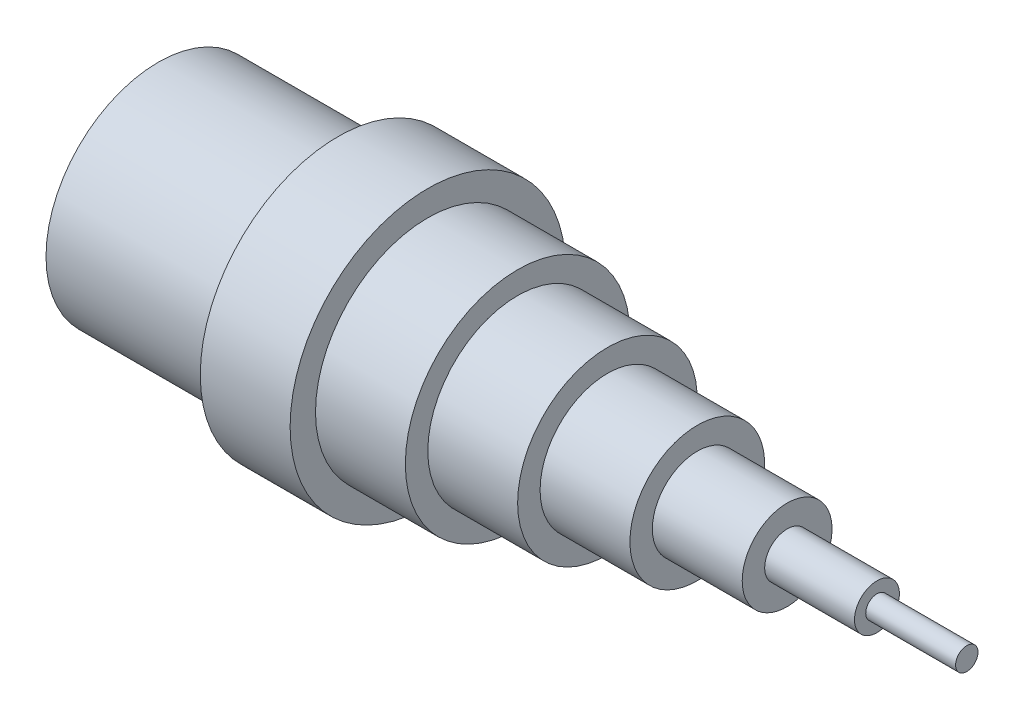
ISO-10303-21;
HEADER;
FILE_DESCRIPTION(('STEP AP214'),'2;1');
FILE_NAME('part.step','',(''),(''),'','','');
FILE_SCHEMA(('AUTOMOTIVE_DESIGN { 1 0 10303 214 1 1 1 1 }'));
ENDSEC;
DATA;
#1=APPLICATION_CONTEXT('core data for automotive mechanical design processes');
#2=APPLICATION_PROTOCOL_DEFINITION('international standard','automotive_design',2000,#1);
#3=PRODUCT_CONTEXT('',#1,'mechanical');
#4=PRODUCT('Part','Part','',(#3));
#5=PRODUCT_RELATED_PRODUCT_CATEGORY('part','',(#4));
#6=PRODUCT_DEFINITION_FORMATION('','',#4);
#7=PRODUCT_DEFINITION_CONTEXT('part definition',#1,'design');
#8=PRODUCT_DEFINITION('design','',#6,#7);
#9=PRODUCT_DEFINITION_SHAPE('','',#8);
#10=(LENGTH_UNIT() NAMED_UNIT(*) SI_UNIT(.MILLI.,.METRE.));
#11=(NAMED_UNIT(*) PLANE_ANGLE_UNIT() SI_UNIT($,.RADIAN.));
#12=(NAMED_UNIT(*) SI_UNIT($,.STERADIAN.) SOLID_ANGLE_UNIT());
#13=UNCERTAINTY_MEASURE_WITH_UNIT(LENGTH_MEASURE(1.E-05),#10,'distance_accuracy_value','');
#14=(GEOMETRIC_REPRESENTATION_CONTEXT(3) GLOBAL_UNCERTAINTY_ASSIGNED_CONTEXT((#13)) GLOBAL_UNIT_ASSIGNED_CONTEXT((#10,
#11,#12)) REPRESENTATION_CONTEXT('',''));
#15=CARTESIAN_POINT('',(0.,0.,0.));
#16=DIRECTION('',(0.,0.,1.));
#17=DIRECTION('',(1.,0.,0.));
#18=AXIS2_PLACEMENT_3D('',#15,#16,#17);
#19=CARTESIAN_POINT('',(0.,0.,0.));
#20=DIRECTION('',(1.,0.,0.));
#21=DIRECTION('',(0.,0.,-1.));
#22=AXIS2_PLACEMENT_3D('',#19,#20,#21);
#23=PLANE('',#22);
#24=CARTESIAN_POINT('',(0.,0.,0.));
#25=DIRECTION('',(-1.,0.,0.));
#26=DIRECTION('',(0.,0.,1.));
#27=AXIS2_PLACEMENT_3D('',#24,#25,#26);
#28=CIRCLE('',#27,20.);
#29=CARTESIAN_POINT('',(0.,0.,20.));
#30=VERTEX_POINT('',#29);
#31=EDGE_CURVE('E87',#30,#30,#28,.T.);
#32=ORIENTED_EDGE('',*,*,#31,.F.);
#33=EDGE_LOOP('',(#32));
#34=FACE_BOUND('',#33,.T.);
#35=CARTESIAN_POINT('',(0.,0.,0.));
#36=DIRECTION('',(-1.,0.,0.));
#37=DIRECTION('',(0.,0.,1.));
#38=AXIS2_PLACEMENT_3D('',#35,#36,#37);
#39=CIRCLE('',#38,25.);
#40=CARTESIAN_POINT('',(0.,0.,25.));
#41=VERTEX_POINT('',#40);
#42=EDGE_CURVE('E10',#41,#41,#39,.T.);
#43=ORIENTED_EDGE('',*,*,#42,.T.);
#44=EDGE_LOOP('',(#43));
#45=FACE_BOUND('',#44,.T.);
#46=ADVANCED_FACE('F31',(#34,#45),#23,.F.);
#47=CARTESIAN_POINT('',(0.,0.,0.));
#48=DIRECTION('',(-1.,0.,0.));
#49=DIRECTION('',(0.,0.,1.));
#50=AXIS2_PLACEMENT_3D('',#47,#48,#49);
#51=CYLINDRICAL_SURFACE('',#50,25.);
#52=ORIENTED_EDGE('',*,*,#42,.F.);
#53=EDGE_LOOP('',(#52));
#54=FACE_BOUND('',#53,.T.);
#55=CARTESIAN_POINT('',(40.,0.,0.));
#56=DIRECTION('',(-1.,0.,0.));
#57=DIRECTION('',(0.,0.,1.));
#58=AXIS2_PLACEMENT_3D('',#55,#56,#57);
#59=CIRCLE('',#58,25.);
#60=CARTESIAN_POINT('',(40.,0.,25.));
#61=VERTEX_POINT('',#60);
#62=EDGE_CURVE('E37',#61,#61,#59,.T.);
#63=ORIENTED_EDGE('',*,*,#62,.T.);
#64=EDGE_LOOP('',(#63));
#65=FACE_BOUND('',#64,.T.);
#66=ADVANCED_FACE('F103',(#54,#65),#51,.T.);
#67=CARTESIAN_POINT('',(40.,25.,0.));
#68=DIRECTION('',(1.,0.,0.));
#69=DIRECTION('',(0.,0.,-1.));
#70=AXIS2_PLACEMENT_3D('',#67,#68,#69);
#71=PLANE('',#70);
#72=ORIENTED_EDGE('',*,*,#62,.F.);
#73=EDGE_LOOP('',(#72));
#74=FACE_BOUND('',#73,.T.);
#75=CARTESIAN_POINT('',(40.,0.,0.));
#76=DIRECTION('',(-1.,0.,0.));
#77=DIRECTION('',(0.,0.,1.));
#78=AXIS2_PLACEMENT_3D('',#75,#76,#77);
#79=CIRCLE('',#78,30.6538802346303);
#80=CARTESIAN_POINT('',(40.,0.,30.6538802346303));
#81=VERTEX_POINT('',#80);
#82=EDGE_CURVE('E41',#81,#81,#79,.T.);
#83=ORIENTED_EDGE('',*,*,#82,.T.);
#84=EDGE_LOOP('',(#83));
#85=FACE_BOUND('',#84,.T.);
#86=ADVANCED_FACE('F107',(#74,#85),#71,.F.);
#87=CARTESIAN_POINT('',(0.,0.,0.));
#88=DIRECTION('',(-1.,0.,0.));
#89=DIRECTION('',(0.,0.,1.));
#90=AXIS2_PLACEMENT_3D('',#87,#88,#89);
#91=CYLINDRICAL_SURFACE('',#90,30.6538802346303);
#92=ORIENTED_EDGE('',*,*,#82,.F.);
#93=EDGE_LOOP('',(#92));
#94=FACE_BOUND('',#93,.T.);
#95=CARTESIAN_POINT('',(60.,0.,0.));
#96=DIRECTION('',(-1.,0.,0.));
#97=DIRECTION('',(0.,0.,1.));
#98=AXIS2_PLACEMENT_3D('',#95,#96,#97);
#99=CIRCLE('',#98,30.6538802346303);
#100=CARTESIAN_POINT('',(60.,0.,30.6538802346303));
#101=VERTEX_POINT('',#100);
#102=EDGE_CURVE('E45',#101,#101,#99,.T.);
#103=ORIENTED_EDGE('',*,*,#102,.T.);
#104=EDGE_LOOP('',(#103));
#105=FACE_BOUND('',#104,.T.);
#106=ADVANCED_FACE('F112',(#94,#105),#91,.T.);
#107=CARTESIAN_POINT('',(60.,30.6538802346303,0.));
#108=DIRECTION('',(-1.,0.,0.));
#109=DIRECTION('',(0.,0.,1.));
#110=AXIS2_PLACEMENT_3D('',#107,#108,#109);
#111=PLANE('',#110);
#112=ORIENTED_EDGE('',*,*,#102,.F.);
#113=EDGE_LOOP('',(#112));
#114=FACE_BOUND('',#113,.T.);
#115=CARTESIAN_POINT('',(60.,0.,0.));
#116=DIRECTION('',(-1.,0.,0.));
#117=DIRECTION('',(0.,0.,1.));
#118=AXIS2_PLACEMENT_3D('',#115,#116,#117);
#119=CIRCLE('',#118,25.);
#120=CARTESIAN_POINT('',(60.,0.,25.));
#121=VERTEX_POINT('',#120);
#122=EDGE_CURVE('E50',#121,#121,#119,.T.);
#123=ORIENTED_EDGE('',*,*,#122,.T.);
#124=EDGE_LOOP('',(#123));
#125=FACE_BOUND('',#124,.T.);
#126=ADVANCED_FACE('F118',(#114,#125),#111,.F.);
#127=CARTESIAN_POINT('',(0.,0.,0.));
#128=DIRECTION('',(-1.,0.,0.));
#129=DIRECTION('',(0.,0.,1.));
#130=AXIS2_PLACEMENT_3D('',#127,#128,#129);
#131=CYLINDRICAL_SURFACE('',#130,25.);
#132=ORIENTED_EDGE('',*,*,#122,.F.);
#133=EDGE_LOOP('',(#132));
#134=FACE_BOUND('',#133,.T.);
#135=CARTESIAN_POINT('',(80.,0.,0.));
#136=DIRECTION('',(-1.,0.,0.));
#137=DIRECTION('',(0.,0.,1.));
#138=AXIS2_PLACEMENT_3D('',#135,#136,#137);
#139=CIRCLE('',#138,25.);
#140=CARTESIAN_POINT('',(80.,0.,25.));
#141=VERTEX_POINT('',#140);
#142=EDGE_CURVE('E53',#141,#141,#139,.T.);
#143=ORIENTED_EDGE('',*,*,#142,.T.);
#144=EDGE_LOOP('',(#143));
#145=FACE_BOUND('',#144,.T.);
#146=ADVANCED_FACE('F122',(#134,#145),#131,.T.);
#147=CARTESIAN_POINT('',(80.,25.,0.));
#148=DIRECTION('',(-1.,0.,0.));
#149=DIRECTION('',(0.,0.,1.));
#150=AXIS2_PLACEMENT_3D('',#147,#148,#149);
#151=PLANE('',#150);
#152=ORIENTED_EDGE('',*,*,#142,.F.);
#153=EDGE_LOOP('',(#152));
#154=FACE_BOUND('',#153,.T.);
#155=CARTESIAN_POINT('',(80.,0.,0.));
#156=DIRECTION('',(-1.,0.,0.));
#157=DIRECTION('',(0.,0.,1.));
#158=AXIS2_PLACEMENT_3D('',#155,#156,#157);
#159=CIRCLE('',#158,20.);
#160=CARTESIAN_POINT('',(80.,0.,20.));
#161=VERTEX_POINT('',#160);
#162=EDGE_CURVE('E56',#161,#161,#159,.T.);
#163=ORIENTED_EDGE('',*,*,#162,.T.);
#164=EDGE_LOOP('',(#163));
#165=FACE_BOUND('',#164,.T.);
#166=ADVANCED_FACE('F126',(#154,#165),#151,.F.);
#167=CARTESIAN_POINT('',(0.,0.,0.));
#168=DIRECTION('',(-1.,0.,0.));
#169=DIRECTION('',(0.,0.,1.));
#170=AXIS2_PLACEMENT_3D('',#167,#168,#169);
#171=CYLINDRICAL_SURFACE('',#170,20.);
#172=ORIENTED_EDGE('',*,*,#162,.F.);
#173=EDGE_LOOP('',(#172));
#174=FACE_BOUND('',#173,.T.);
#175=CARTESIAN_POINT('',(100.,0.,0.));
#176=DIRECTION('',(-1.,0.,0.));
#177=DIRECTION('',(0.,0.,1.));
#178=AXIS2_PLACEMENT_3D('',#175,#176,#177);
#179=CIRCLE('',#178,20.);
#180=CARTESIAN_POINT('',(100.,0.,20.));
#181=VERTEX_POINT('',#180);
#182=EDGE_CURVE('E59',#181,#181,#179,.T.);
#183=ORIENTED_EDGE('',*,*,#182,.T.);
#184=EDGE_LOOP('',(#183));
#185=FACE_BOUND('',#184,.T.);
#186=ADVANCED_FACE('F130',(#174,#185),#171,.T.);
#187=CARTESIAN_POINT('',(100.,20.,0.));
#188=DIRECTION('',(-1.,0.,0.));
#189=DIRECTION('',(0.,0.,1.));
#190=AXIS2_PLACEMENT_3D('',#187,#188,#189);
#191=PLANE('',#190);
#192=ORIENTED_EDGE('',*,*,#182,.F.);
#193=EDGE_LOOP('',(#192));
#194=FACE_BOUND('',#193,.T.);
#195=CARTESIAN_POINT('',(100.,0.,0.));
#196=DIRECTION('',(-1.,0.,0.));
#197=DIRECTION('',(0.,0.,1.));
#198=AXIS2_PLACEMENT_3D('',#195,#196,#197);
#199=CIRCLE('',#198,15.);
#200=CARTESIAN_POINT('',(100.,0.,15.));
#201=VERTEX_POINT('',#200);
#202=EDGE_CURVE('E62',#201,#201,#199,.T.);
#203=ORIENTED_EDGE('',*,*,#202,.T.);
#204=EDGE_LOOP('',(#203));
#205=FACE_BOUND('',#204,.T.);
#206=ADVANCED_FACE('F134',(#194,#205),#191,.F.);
#207=CARTESIAN_POINT('',(0.,0.,0.));
#208=DIRECTION('',(-1.,0.,0.));
#209=DIRECTION('',(0.,0.,1.));
#210=AXIS2_PLACEMENT_3D('',#207,#208,#209);
#211=CYLINDRICAL_SURFACE('',#210,15.);
#212=ORIENTED_EDGE('',*,*,#202,.F.);
#213=EDGE_LOOP('',(#212));
#214=FACE_BOUND('',#213,.T.);
#215=CARTESIAN_POINT('',(120.,0.,0.));
#216=DIRECTION('',(-1.,0.,0.));
#217=DIRECTION('',(0.,0.,1.));
#218=AXIS2_PLACEMENT_3D('',#215,#216,#217);
#219=CIRCLE('',#218,15.);
#220=CARTESIAN_POINT('',(120.,0.,15.));
#221=VERTEX_POINT('',#220);
#222=EDGE_CURVE('E65',#221,#221,#219,.T.);
#223=ORIENTED_EDGE('',*,*,#222,.T.);
#224=EDGE_LOOP('',(#223));
#225=FACE_BOUND('',#224,.T.);
#226=ADVANCED_FACE('F138',(#214,#225),#211,.T.);
#227=CARTESIAN_POINT('',(120.,15.,0.));
#228=DIRECTION('',(-1.,0.,0.));
#229=DIRECTION('',(0.,0.,1.));
#230=AXIS2_PLACEMENT_3D('',#227,#228,#229);
#231=PLANE('',#230);
#232=ORIENTED_EDGE('',*,*,#222,.F.);
#233=EDGE_LOOP('',(#232));
#234=FACE_BOUND('',#233,.T.);
#235=CARTESIAN_POINT('',(120.,0.,0.));
#236=DIRECTION('',(-1.,0.,0.));
#237=DIRECTION('',(0.,0.,1.));
#238=AXIS2_PLACEMENT_3D('',#235,#236,#237);
#239=CIRCLE('',#238,10.);
#240=CARTESIAN_POINT('',(120.,0.,10.));
#241=VERTEX_POINT('',#240);
#242=EDGE_CURVE('E68',#241,#241,#239,.T.);
#243=ORIENTED_EDGE('',*,*,#242,.T.);
#244=EDGE_LOOP('',(#243));
#245=FACE_BOUND('',#244,.T.);
#246=ADVANCED_FACE('F142',(#234,#245),#231,.F.);
#247=CARTESIAN_POINT('',(0.,0.,0.));
#248=DIRECTION('',(-1.,0.,0.));
#249=DIRECTION('',(0.,0.,1.));
#250=AXIS2_PLACEMENT_3D('',#247,#248,#249);
#251=CYLINDRICAL_SURFACE('',#250,10.);
#252=ORIENTED_EDGE('',*,*,#242,.F.);
#253=EDGE_LOOP('',(#252));
#254=FACE_BOUND('',#253,.T.);
#255=CARTESIAN_POINT('',(140.,0.,0.));
#256=DIRECTION('',(-1.,0.,0.));
#257=DIRECTION('',(0.,0.,1.));
#258=AXIS2_PLACEMENT_3D('',#255,#256,#257);
#259=CIRCLE('',#258,10.);
#260=CARTESIAN_POINT('',(140.,0.,10.));
#261=VERTEX_POINT('',#260);
#262=EDGE_CURVE('E71',#261,#261,#259,.T.);
#263=ORIENTED_EDGE('',*,*,#262,.T.);
#264=EDGE_LOOP('',(#263));
#265=FACE_BOUND('',#264,.T.);
#266=ADVANCED_FACE('F146',(#254,#265),#251,.T.);
#267=CARTESIAN_POINT('',(140.,10.,0.));
#268=DIRECTION('',(-1.,0.,0.));
#269=DIRECTION('',(0.,0.,1.));
#270=AXIS2_PLACEMENT_3D('',#267,#268,#269);
#271=PLANE('',#270);
#272=ORIENTED_EDGE('',*,*,#262,.F.);
#273=EDGE_LOOP('',(#272));
#274=FACE_BOUND('',#273,.T.);
#275=CARTESIAN_POINT('',(140.,0.,0.));
#276=DIRECTION('',(-1.,0.,0.));
#277=DIRECTION('',(0.,0.,1.));
#278=AXIS2_PLACEMENT_3D('',#275,#276,#277);
#279=CIRCLE('',#278,5.);
#280=CARTESIAN_POINT('',(140.,0.,5.));
#281=VERTEX_POINT('',#280);
#282=EDGE_CURVE('E74',#281,#281,#279,.T.);
#283=ORIENTED_EDGE('',*,*,#282,.T.);
#284=EDGE_LOOP('',(#283));
#285=FACE_BOUND('',#284,.T.);
#286=ADVANCED_FACE('F150',(#274,#285),#271,.F.);
#287=CARTESIAN_POINT('',(0.,0.,0.));
#288=DIRECTION('',(-1.,0.,0.));
#289=DIRECTION('',(0.,0.,1.));
#290=AXIS2_PLACEMENT_3D('',#287,#288,#289);
#291=CYLINDRICAL_SURFACE('',#290,5.);
#292=ORIENTED_EDGE('',*,*,#282,.F.);
#293=EDGE_LOOP('',(#292));
#294=FACE_BOUND('',#293,.T.);
#295=CARTESIAN_POINT('',(160.,0.,0.));
#296=DIRECTION('',(-1.,0.,0.));
#297=DIRECTION('',(0.,0.,1.));
#298=AXIS2_PLACEMENT_3D('',#295,#296,#297);
#299=CIRCLE('',#298,5.);
#300=CARTESIAN_POINT('',(160.,0.,5.));
#301=VERTEX_POINT('',#300);
#302=EDGE_CURVE('E77',#301,#301,#299,.T.);
#303=ORIENTED_EDGE('',*,*,#302,.T.);
#304=EDGE_LOOP('',(#303));
#305=FACE_BOUND('',#304,.T.);
#306=ADVANCED_FACE('F154',(#294,#305),#291,.T.);
#307=CARTESIAN_POINT('',(160.,5.,0.));
#308=DIRECTION('',(-1.,0.,0.));
#309=DIRECTION('',(0.,0.,1.));
#310=AXIS2_PLACEMENT_3D('',#307,#308,#309);
#311=PLANE('',#310);
#312=ORIENTED_EDGE('',*,*,#302,.F.);
#313=EDGE_LOOP('',(#312));
#314=FACE_BOUND('',#313,.T.);
#315=CARTESIAN_POINT('',(160.,0.,0.));
#316=DIRECTION('',(-1.,0.,0.));
#317=DIRECTION('',(0.,0.,1.));
#318=AXIS2_PLACEMENT_3D('',#315,#316,#317);
#319=CIRCLE('',#318,2.5);
#320=CARTESIAN_POINT('',(160.,0.,2.5));
#321=VERTEX_POINT('',#320);
#322=EDGE_CURVE('E80',#321,#321,#319,.T.);
#323=ORIENTED_EDGE('',*,*,#322,.T.);
#324=EDGE_LOOP('',(#323));
#325=FACE_BOUND('',#324,.T.);
#326=ADVANCED_FACE('F158',(#314,#325),#311,.F.);
#327=CARTESIAN_POINT('',(0.,0.,0.));
#328=DIRECTION('',(-1.,0.,0.));
#329=DIRECTION('',(0.,0.,1.));
#330=AXIS2_PLACEMENT_3D('',#327,#328,#329);
#331=CYLINDRICAL_SURFACE('',#330,2.5);
#332=ORIENTED_EDGE('',*,*,#322,.F.);
#333=EDGE_LOOP('',(#332));
#334=FACE_BOUND('',#333,.T.);
#335=CARTESIAN_POINT('',(180.,0.,0.));
#336=DIRECTION('',(-1.,0.,0.));
#337=DIRECTION('',(0.,0.,1.));
#338=AXIS2_PLACEMENT_3D('',#335,#336,#337);
#339=CIRCLE('',#338,2.5);
#340=CARTESIAN_POINT('',(180.,0.,2.5));
#341=VERTEX_POINT('',#340);
#342=EDGE_CURVE('E83',#341,#341,#339,.T.);
#343=ORIENTED_EDGE('',*,*,#342,.T.);
#344=EDGE_LOOP('',(#343));
#345=FACE_BOUND('',#344,.T.);
#346=ADVANCED_FACE('F162',(#334,#345),#331,.T.);
#347=CARTESIAN_POINT('',(180.,2.5,0.));
#348=DIRECTION('',(-1.,0.,0.));
#349=DIRECTION('',(0.,0.,1.));
#350=AXIS2_PLACEMENT_3D('',#347,#348,#349);
#351=PLANE('',#350);
#352=ORIENTED_EDGE('',*,*,#342,.F.);
#353=EDGE_LOOP('',(#352));
#354=FACE_BOUND('',#353,.T.);
#355=ADVANCED_FACE('F98',(#354),#351,.F.);
#356=CARTESIAN_POINT('',(40.,0.,0.));
#357=DIRECTION('',(-1.,0.,0.));
#358=DIRECTION('',(0.,0.,1.));
#359=AXIS2_PLACEMENT_3D('',#356,#357,#358);
#360=CYLINDRICAL_SURFACE('',#359,20.);
#361=CARTESIAN_POINT('',(40.,0.,0.));
#362=DIRECTION('',(-1.,0.,0.));
#363=DIRECTION('',(0.,0.,1.));
#364=AXIS2_PLACEMENT_3D('',#361,#362,#363);
#365=CIRCLE('',#364,20.);
#366=CARTESIAN_POINT('',(40.,0.,20.));
#367=VERTEX_POINT('',#366);
#368=EDGE_CURVE('E86',#367,#367,#365,.T.);
#369=ORIENTED_EDGE('',*,*,#368,.F.);
#370=EDGE_LOOP('',(#369));
#371=FACE_BOUND('',#370,.T.);
#372=ORIENTED_EDGE('',*,*,#31,.T.);
#373=EDGE_LOOP('',(#372));
#374=FACE_BOUND('',#373,.T.);
#375=ADVANCED_FACE('F95',(#371,#374),#360,.F.);
#376=CARTESIAN_POINT('',(40.,0.,0.));
#377=DIRECTION('',(-1.,0.,0.));
#378=DIRECTION('',(0.,0.,1.));
#379=AXIS2_PLACEMENT_3D('',#376,#377,#378);
#380=PLANE('',#379);
#381=ORIENTED_EDGE('',*,*,#368,.T.);
#382=EDGE_LOOP('',(#381));
#383=FACE_BOUND('',#382,.T.);
#384=ADVANCED_FACE('F93',(#383),#380,.T.);
#385=CLOSED_SHELL('',(#46,#66,#86,#106,#126,#146,#166,#186,#206,#226,#246,#266,#286,#306,#326,
#346,#355,#375,#384));
#386=MANIFOLD_SOLID_BREP('B2',#385);
#387=ADVANCED_BREP_SHAPE_REPRESENTATION('',(#18,#386),#14);
#388=SHAPE_DEFINITION_REPRESENTATION(#9,#387);
ENDSEC;
END-ISO-10303-21;
